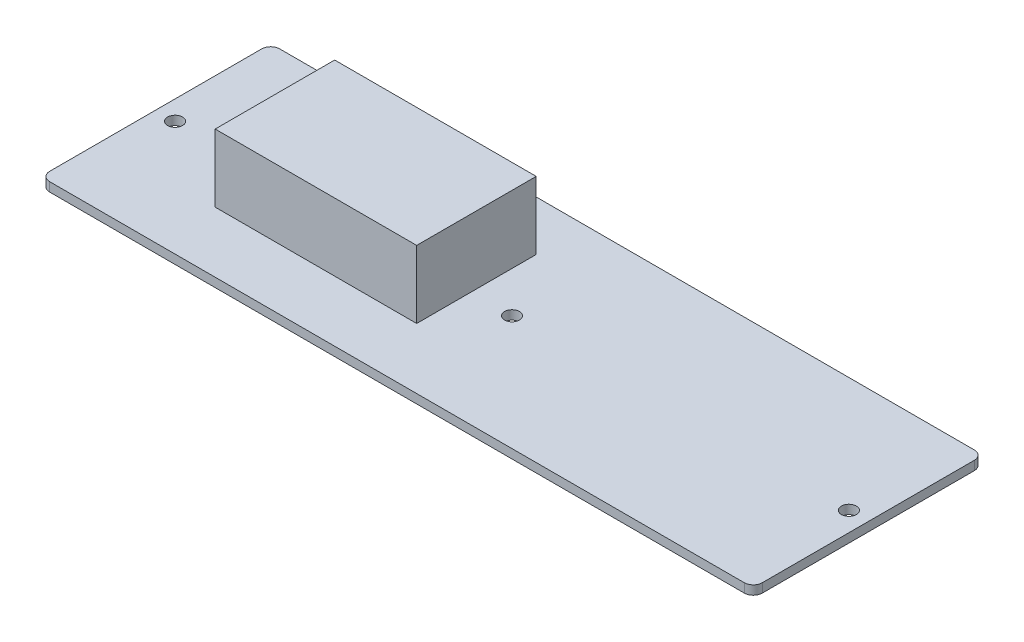
ISO-10303-21;
HEADER;
FILE_DESCRIPTION(('STEP AP214'),'2;1');
FILE_NAME('part.step','',(''),(''),'','','');
FILE_SCHEMA(('AUTOMOTIVE_DESIGN { 1 0 10303 214 1 1 1 1 }'));
ENDSEC;
DATA;
#1=APPLICATION_CONTEXT('core data for automotive mechanical design processes');
#2=APPLICATION_PROTOCOL_DEFINITION('international standard','automotive_design',2000,#1);
#3=PRODUCT_CONTEXT('',#1,'mechanical');
#4=PRODUCT('Part','Part','',(#3));
#5=PRODUCT_RELATED_PRODUCT_CATEGORY('part','',(#4));
#6=PRODUCT_DEFINITION_FORMATION('','',#4);
#7=PRODUCT_DEFINITION_CONTEXT('part definition',#1,'design');
#8=PRODUCT_DEFINITION('design','',#6,#7);
#9=PRODUCT_DEFINITION_SHAPE('','',#8);
#10=(LENGTH_UNIT() NAMED_UNIT(*) SI_UNIT(.MILLI.,.METRE.));
#11=(NAMED_UNIT(*) PLANE_ANGLE_UNIT() SI_UNIT($,.RADIAN.));
#12=(NAMED_UNIT(*) SI_UNIT($,.STERADIAN.) SOLID_ANGLE_UNIT());
#13=UNCERTAINTY_MEASURE_WITH_UNIT(LENGTH_MEASURE(1.E-05),#10,'distance_accuracy_value','');
#14=(GEOMETRIC_REPRESENTATION_CONTEXT(3) GLOBAL_UNCERTAINTY_ASSIGNED_CONTEXT((#13)) GLOBAL_UNIT_ASSIGNED_CONTEXT((#10,
#11,#12)) REPRESENTATION_CONTEXT('',''));
#15=CARTESIAN_POINT('',(0.,0.,0.));
#16=DIRECTION('',(0.,0.,1.));
#17=DIRECTION('',(1.,0.,0.));
#18=AXIS2_PLACEMENT_3D('',#15,#16,#17);
#19=CARTESIAN_POINT('',(0.,2.,0.));
#20=DIRECTION('',(0.,-1.,0.));
#21=DIRECTION('',(0.,0.,-1.));
#22=AXIS2_PLACEMENT_3D('',#19,#20,#21);
#23=PLANE('',#22);
#24=DIRECTION('',(1.,0.,0.));
#25=VECTOR('',#24,1.);
#26=CARTESIAN_POINT('',(0.,2.,0.));
#27=LINE('',#26,#25);
#28=CARTESIAN_POINT('',(2.,2.,0.));
#29=VERTEX_POINT('',#28);
#30=CARTESIAN_POINT('',(156.,2.,0.));
#31=VERTEX_POINT('',#30);
#32=EDGE_CURVE('E172',#29,#31,#27,.T.);
#33=ORIENTED_EDGE('',*,*,#32,.T.);
#34=CARTESIAN_POINT('',(156.,2.,-2.));
#35=DIRECTION('',(0.,-1.,0.));
#36=DIRECTION('',(0.,0.,-1.));
#37=AXIS2_PLACEMENT_3D('',#34,#35,#36);
#38=CIRCLE('',#37,2.);
#39=CARTESIAN_POINT('',(158.,2.,-2.));
#40=VERTEX_POINT('',#39);
#41=EDGE_CURVE('E216',#31,#40,#38,.F.);
#42=ORIENTED_EDGE('',*,*,#41,.T.);
#43=DIRECTION('',(0.,0.,-1.));
#44=VECTOR('',#43,1.);
#45=CARTESIAN_POINT('',(158.,2.,0.));
#46=LINE('',#45,#44);
#47=CARTESIAN_POINT('',(158.,2.,-49.));
#48=VERTEX_POINT('',#47);
#49=EDGE_CURVE('E176',#40,#48,#46,.T.);
#50=ORIENTED_EDGE('',*,*,#49,.T.);
#51=CARTESIAN_POINT('',(156.,2.,-49.));
#52=DIRECTION('',(0.,-1.,0.));
#53=DIRECTION('',(0.,0.,-1.));
#54=AXIS2_PLACEMENT_3D('',#51,#52,#53);
#55=CIRCLE('',#54,2.);
#56=CARTESIAN_POINT('',(156.,2.,-51.));
#57=VERTEX_POINT('',#56);
#58=EDGE_CURVE('E214',#48,#57,#55,.F.);
#59=ORIENTED_EDGE('',*,*,#58,.T.);
#60=DIRECTION('',(-1.,0.,0.));
#61=VECTOR('',#60,1.);
#62=CARTESIAN_POINT('',(0.,2.,-51.));
#63=LINE('',#62,#61);
#64=CARTESIAN_POINT('',(2.,2.,-51.));
#65=VERTEX_POINT('',#64);
#66=EDGE_CURVE('E179',#57,#65,#63,.T.);
#67=ORIENTED_EDGE('',*,*,#66,.T.);
#68=CARTESIAN_POINT('',(2.,2.,-49.));
#69=DIRECTION('',(0.,-1.,0.));
#70=DIRECTION('',(0.,0.,-1.));
#71=AXIS2_PLACEMENT_3D('',#68,#69,#70);
#72=CIRCLE('',#71,2.);
#73=CARTESIAN_POINT('',(0.,2.,-49.));
#74=VERTEX_POINT('',#73);
#75=EDGE_CURVE('E212',#65,#74,#72,.F.);
#76=ORIENTED_EDGE('',*,*,#75,.T.);
#77=DIRECTION('',(0.,0.,1.));
#78=VECTOR('',#77,1.);
#79=CARTESIAN_POINT('',(0.,2.,0.));
#80=LINE('',#79,#78);
#81=CARTESIAN_POINT('',(0.,2.,-2.));
#82=VERTEX_POINT('',#81);
#83=EDGE_CURVE('E169',#74,#82,#80,.T.);
#84=ORIENTED_EDGE('',*,*,#83,.T.);
#85=CARTESIAN_POINT('',(2.,2.,-2.));
#86=DIRECTION('',(0.,-1.,0.));
#87=DIRECTION('',(0.,0.,-1.));
#88=AXIS2_PLACEMENT_3D('',#85,#86,#87);
#89=CIRCLE('',#88,2.);
#90=EDGE_CURVE('E210',#82,#29,#89,.F.);
#91=ORIENTED_EDGE('',*,*,#90,.T.);
#92=EDGE_LOOP('',(#33,#42,#50,#59,#67,#76,#84,#91));
#93=FACE_BOUND('',#92,.T.);
#94=CARTESIAN_POINT('',(4.3,2.,-25.5));
#95=DIRECTION('',(0.,1.,0.));
#96=DIRECTION('',(0.,0.,1.));
#97=AXIS2_PLACEMENT_3D('',#94,#95,#96);
#98=CIRCLE('',#97,1.65);
#99=CARTESIAN_POINT('',(4.3,2.,-23.85));
#100=VERTEX_POINT('',#99);
#101=EDGE_CURVE('E157',#100,#100,#98,.T.);
#102=ORIENTED_EDGE('',*,*,#101,.F.);
#103=EDGE_LOOP('',(#102));
#104=FACE_BOUND('',#103,.T.);
#105=CARTESIAN_POINT('',(79.,2.,-25.5));
#106=DIRECTION('',(0.,1.,0.));
#107=DIRECTION('',(0.,0.,1.));
#108=AXIS2_PLACEMENT_3D('',#105,#106,#107);
#109=CIRCLE('',#108,1.65);
#110=CARTESIAN_POINT('',(79.,2.,-23.85));
#111=VERTEX_POINT('',#110);
#112=EDGE_CURVE('E145',#111,#111,#109,.T.);
#113=ORIENTED_EDGE('',*,*,#112,.F.);
#114=EDGE_LOOP('',(#113));
#115=FACE_BOUND('',#114,.T.);
#116=CARTESIAN_POINT('',(153.7,2.,-25.5));
#117=DIRECTION('',(0.,1.,0.));
#118=DIRECTION('',(0.,0.,-1.));
#119=AXIS2_PLACEMENT_3D('',#116,#117,#118);
#120=CIRCLE('',#119,1.64999999999999);
#121=CARTESIAN_POINT('',(153.7,2.,-27.15));
#122=VERTEX_POINT('',#121);
#123=EDGE_CURVE('E158',#122,#122,#120,.T.);
#124=ORIENTED_EDGE('',*,*,#123,.F.);
#125=EDGE_LOOP('',(#124));
#126=FACE_BOUND('',#125,.T.);
#127=DIRECTION('',(0.,0.,1.));
#128=VECTOR('',#127,1.);
#129=CARTESIAN_POINT('',(25.2313707372993,2.,-13.4540749105972));
#130=LINE('',#129,#128);
#131=CARTESIAN_POINT('',(25.2313707372993,2.,-39.9551101072841));
#132=VERTEX_POINT('',#131);
#133=CARTESIAN_POINT('',(25.2313707372993,2.,-13.4540749105972));
#134=VERTEX_POINT('',#133);
#135=EDGE_CURVE('E144',#132,#134,#130,.T.);
#136=ORIENTED_EDGE('',*,*,#135,.F.);
#137=DIRECTION('',(-1.,0.,0.));
#138=VECTOR('',#137,1.);
#139=CARTESIAN_POINT('',(25.2313707372993,2.,-39.9551101072841));
#140=LINE('',#139,#138);
#141=CARTESIAN_POINT('',(69.9108019779958,2.,-39.9551101072841));
#142=VERTEX_POINT('',#141);
#143=EDGE_CURVE('E141',#142,#132,#140,.T.);
#144=ORIENTED_EDGE('',*,*,#143,.F.);
#145=DIRECTION('',(0.,0.,-1.));
#146=VECTOR('',#145,1.);
#147=CARTESIAN_POINT('',(69.9108019779958,2.,-13.4540749105972));
#148=LINE('',#147,#146);
#149=CARTESIAN_POINT('',(69.9108019779958,2.,-13.4540749105972));
#150=VERTEX_POINT('',#149);
#151=EDGE_CURVE('E55',#150,#142,#148,.T.);
#152=ORIENTED_EDGE('',*,*,#151,.F.);
#153=DIRECTION('',(1.,0.,0.));
#154=VECTOR('',#153,1.);
#155=CARTESIAN_POINT('',(25.2313707372993,2.,-13.4540749105972));
#156=LINE('',#155,#154);
#157=EDGE_CURVE('E50',#134,#150,#156,.T.);
#158=ORIENTED_EDGE('',*,*,#157,.F.);
#159=EDGE_LOOP('',(#136,#144,#152,#158));
#160=FACE_BOUND('',#159,.T.);
#161=ADVANCED_FACE('F35',(#93,#104,#115,#126,#160),#23,.F.);
#162=CARTESIAN_POINT('',(0.,2.,0.));
#163=DIRECTION('',(1.,0.,0.));
#164=DIRECTION('',(0.,0.,-1.));
#165=AXIS2_PLACEMENT_3D('',#162,#163,#164);
#166=PLANE('',#165);
#167=ORIENTED_EDGE('',*,*,#83,.F.);
#168=DIRECTION('',(0.,-1.,0.));
#169=VECTOR('',#168,1.);
#170=CARTESIAN_POINT('',(0.,2.,-49.));
#171=LINE('',#170,#169);
#172=CARTESIAN_POINT('',(0.,0.,-49.));
#173=VERTEX_POINT('',#172);
#174=EDGE_CURVE('E11',#74,#173,#171,.T.);
#175=ORIENTED_EDGE('',*,*,#174,.T.);
#176=DIRECTION('',(0.,0.,1.));
#177=VECTOR('',#176,1.);
#178=CARTESIAN_POINT('',(0.,0.,0.));
#179=LINE('',#178,#177);
#180=CARTESIAN_POINT('',(0.,0.,-2.));
#181=VERTEX_POINT('',#180);
#182=EDGE_CURVE('E166',#173,#181,#179,.T.);
#183=ORIENTED_EDGE('',*,*,#182,.T.);
#184=DIRECTION('',(0.,-1.,0.));
#185=VECTOR('',#184,1.);
#186=CARTESIAN_POINT('',(0.,2.,-2.));
#187=LINE('',#186,#185);
#188=EDGE_CURVE('E43',#181,#82,#187,.F.);
#189=ORIENTED_EDGE('',*,*,#188,.T.);
#190=EDGE_LOOP('',(#167,#175,#183,#189));
#191=FACE_BOUND('',#190,.T.);
#192=ADVANCED_FACE('F225',(#191),#166,.F.);
#193=CARTESIAN_POINT('',(0.,2.,0.));
#194=DIRECTION('',(0.,0.,-1.));
#195=DIRECTION('',(-1.,0.,0.));
#196=AXIS2_PLACEMENT_3D('',#193,#194,#195);
#197=PLANE('',#196);
#198=DIRECTION('',(1.,0.,0.));
#199=VECTOR('',#198,1.);
#200=CARTESIAN_POINT('',(0.,0.,0.));
#201=LINE('',#200,#199);
#202=CARTESIAN_POINT('',(2.,0.,0.));
#203=VERTEX_POINT('',#202);
#204=CARTESIAN_POINT('',(156.,0.,0.));
#205=VERTEX_POINT('',#204);
#206=EDGE_CURVE('E185',#203,#205,#201,.T.);
#207=ORIENTED_EDGE('',*,*,#206,.T.);
#208=DIRECTION('',(0.,-1.,0.));
#209=VECTOR('',#208,1.);
#210=CARTESIAN_POINT('',(156.,2.,0.));
#211=LINE('',#210,#209);
#212=EDGE_CURVE('E208',#205,#31,#211,.F.);
#213=ORIENTED_EDGE('',*,*,#212,.T.);
#214=ORIENTED_EDGE('',*,*,#32,.F.);
#215=DIRECTION('',(0.,-1.,0.));
#216=VECTOR('',#215,1.);
#217=CARTESIAN_POINT('',(2.,2.,0.));
#218=LINE('',#217,#216);
#219=EDGE_CURVE('E205',#29,#203,#218,.T.);
#220=ORIENTED_EDGE('',*,*,#219,.T.);
#221=EDGE_LOOP('',(#207,#213,#214,#220));
#222=FACE_BOUND('',#221,.T.);
#223=ADVANCED_FACE('F237',(#222),#197,.F.);
#224=CARTESIAN_POINT('',(158.,2.,0.));
#225=DIRECTION('',(-1.,0.,0.));
#226=DIRECTION('',(0.,0.,1.));
#227=AXIS2_PLACEMENT_3D('',#224,#225,#226);
#228=PLANE('',#227);
#229=ORIENTED_EDGE('',*,*,#49,.F.);
#230=DIRECTION('',(0.,-1.,0.));
#231=VECTOR('',#230,1.);
#232=CARTESIAN_POINT('',(158.,2.,-2.));
#233=LINE('',#232,#231);
#234=CARTESIAN_POINT('',(158.,0.,-2.));
#235=VERTEX_POINT('',#234);
#236=EDGE_CURVE('E194',#40,#235,#233,.T.);
#237=ORIENTED_EDGE('',*,*,#236,.T.);
#238=DIRECTION('',(0.,0.,-1.));
#239=VECTOR('',#238,1.);
#240=CARTESIAN_POINT('',(158.,0.,0.));
#241=LINE('',#240,#239);
#242=CARTESIAN_POINT('',(158.,0.,-49.));
#243=VERTEX_POINT('',#242);
#244=EDGE_CURVE('E188',#235,#243,#241,.T.);
#245=ORIENTED_EDGE('',*,*,#244,.T.);
#246=DIRECTION('',(0.,-1.,0.));
#247=VECTOR('',#246,1.);
#248=CARTESIAN_POINT('',(158.,2.,-49.));
#249=LINE('',#248,#247);
#250=EDGE_CURVE('E182',#243,#48,#249,.F.);
#251=ORIENTED_EDGE('',*,*,#250,.T.);
#252=EDGE_LOOP('',(#229,#237,#245,#251));
#253=FACE_BOUND('',#252,.T.);
#254=ADVANCED_FACE('F248',(#253),#228,.F.);
#255=CARTESIAN_POINT('',(0.,2.,-51.));
#256=DIRECTION('',(0.,0.,1.));
#257=DIRECTION('',(1.,0.,0.));
#258=AXIS2_PLACEMENT_3D('',#255,#256,#257);
#259=PLANE('',#258);
#260=ORIENTED_EDGE('',*,*,#66,.F.);
#261=DIRECTION('',(0.,-1.,0.));
#262=VECTOR('',#261,1.);
#263=CARTESIAN_POINT('',(156.,2.,-51.));
#264=LINE('',#263,#262);
#265=CARTESIAN_POINT('',(156.,0.,-51.));
#266=VERTEX_POINT('',#265);
#267=EDGE_CURVE('E220',#57,#266,#264,.T.);
#268=ORIENTED_EDGE('',*,*,#267,.T.);
#269=DIRECTION('',(-1.,0.,0.));
#270=VECTOR('',#269,1.);
#271=CARTESIAN_POINT('',(0.,0.,-51.));
#272=LINE('',#271,#270);
#273=CARTESIAN_POINT('',(2.,0.,-51.));
#274=VERTEX_POINT('',#273);
#275=EDGE_CURVE('E173',#266,#274,#272,.T.);
#276=ORIENTED_EDGE('',*,*,#275,.T.);
#277=DIRECTION('',(0.,-1.,0.));
#278=VECTOR('',#277,1.);
#279=CARTESIAN_POINT('',(2.,2.,-51.));
#280=LINE('',#279,#278);
#281=EDGE_CURVE('E218',#274,#65,#280,.F.);
#282=ORIENTED_EDGE('',*,*,#281,.T.);
#283=EDGE_LOOP('',(#260,#268,#276,#282));
#284=FACE_BOUND('',#283,.T.);
#285=ADVANCED_FACE('F257',(#284),#259,.F.);
#286=CARTESIAN_POINT('',(0.,0.,0.));
#287=DIRECTION('',(0.,-1.,0.));
#288=DIRECTION('',(0.,0.,-1.));
#289=AXIS2_PLACEMENT_3D('',#286,#287,#288);
#290=PLANE('',#289);
#291=CARTESIAN_POINT('',(153.7,0.,-25.5));
#292=DIRECTION('',(0.,1.,0.));
#293=DIRECTION('',(0.,0.,-1.));
#294=AXIS2_PLACEMENT_3D('',#291,#292,#293);
#295=CIRCLE('',#294,1.64999999999999);
#296=CARTESIAN_POINT('',(153.7,0.,-27.15));
#297=VERTEX_POINT('',#296);
#298=EDGE_CURVE('E154',#297,#297,#295,.T.);
#299=ORIENTED_EDGE('',*,*,#298,.T.);
#300=EDGE_LOOP('',(#299));
#301=FACE_BOUND('',#300,.T.);
#302=CARTESIAN_POINT('',(79.,0.,-25.5));
#303=DIRECTION('',(0.,1.,0.));
#304=DIRECTION('',(0.,0.,1.));
#305=AXIS2_PLACEMENT_3D('',#302,#303,#304);
#306=CIRCLE('',#305,1.65);
#307=CARTESIAN_POINT('',(79.,0.,-23.85));
#308=VERTEX_POINT('',#307);
#309=EDGE_CURVE('E148',#308,#308,#306,.T.);
#310=ORIENTED_EDGE('',*,*,#309,.T.);
#311=EDGE_LOOP('',(#310));
#312=FACE_BOUND('',#311,.T.);
#313=CARTESIAN_POINT('',(4.3,0.,-25.5));
#314=DIRECTION('',(0.,1.,0.));
#315=DIRECTION('',(0.,0.,1.));
#316=AXIS2_PLACEMENT_3D('',#313,#314,#315);
#317=CIRCLE('',#316,1.65);
#318=CARTESIAN_POINT('',(4.3,0.,-23.85));
#319=VERTEX_POINT('',#318);
#320=EDGE_CURVE('E163',#319,#319,#317,.T.);
#321=ORIENTED_EDGE('',*,*,#320,.T.);
#322=EDGE_LOOP('',(#321));
#323=FACE_BOUND('',#322,.T.);
#324=ORIENTED_EDGE('',*,*,#244,.F.);
#325=CARTESIAN_POINT('',(156.,0.,-2.));
#326=DIRECTION('',(0.,-1.,0.));
#327=DIRECTION('',(0.,0.,-1.));
#328=AXIS2_PLACEMENT_3D('',#325,#326,#327);
#329=CIRCLE('',#328,2.);
#330=EDGE_CURVE('E203',#235,#205,#329,.T.);
#331=ORIENTED_EDGE('',*,*,#330,.T.);
#332=ORIENTED_EDGE('',*,*,#206,.F.);
#333=CARTESIAN_POINT('',(2.,0.,-2.));
#334=DIRECTION('',(0.,-1.,0.));
#335=DIRECTION('',(0.,0.,-1.));
#336=AXIS2_PLACEMENT_3D('',#333,#334,#335);
#337=CIRCLE('',#336,2.);
#338=EDGE_CURVE('E197',#203,#181,#337,.T.);
#339=ORIENTED_EDGE('',*,*,#338,.T.);
#340=ORIENTED_EDGE('',*,*,#182,.F.);
#341=CARTESIAN_POINT('',(2.,0.,-49.));
#342=DIRECTION('',(0.,-1.,0.));
#343=DIRECTION('',(0.,0.,-1.));
#344=AXIS2_PLACEMENT_3D('',#341,#342,#343);
#345=CIRCLE('',#344,2.);
#346=EDGE_CURVE('E199',#173,#274,#345,.T.);
#347=ORIENTED_EDGE('',*,*,#346,.T.);
#348=ORIENTED_EDGE('',*,*,#275,.F.);
#349=CARTESIAN_POINT('',(156.,0.,-49.));
#350=DIRECTION('',(0.,-1.,0.));
#351=DIRECTION('',(0.,0.,-1.));
#352=AXIS2_PLACEMENT_3D('',#349,#350,#351);
#353=CIRCLE('',#352,2.);
#354=EDGE_CURVE('E201',#266,#243,#353,.T.);
#355=ORIENTED_EDGE('',*,*,#354,.T.);
#356=EDGE_LOOP('',(#324,#331,#332,#339,#340,#347,#348,#355));
#357=FACE_BOUND('',#356,.T.);
#358=ADVANCED_FACE('F241',(#301,#312,#323,#357),#290,.T.);
#359=CARTESIAN_POINT('',(4.3,0.,-25.5));
#360=DIRECTION('',(0.,1.,0.));
#361=DIRECTION('',(0.,0.,1.));
#362=AXIS2_PLACEMENT_3D('',#359,#360,#361);
#363=CYLINDRICAL_SURFACE('',#362,1.65);
#364=ORIENTED_EDGE('',*,*,#320,.F.);
#365=EDGE_LOOP('',(#364));
#366=FACE_BOUND('',#365,.T.);
#367=ORIENTED_EDGE('',*,*,#101,.T.);
#368=EDGE_LOOP('',(#367));
#369=FACE_BOUND('',#368,.T.);
#370=ADVANCED_FACE('F277',(#366,#369),#363,.F.);
#371=CARTESIAN_POINT('',(79.,0.,-25.5));
#372=DIRECTION('',(0.,1.,0.));
#373=DIRECTION('',(0.,0.,1.));
#374=AXIS2_PLACEMENT_3D('',#371,#372,#373);
#375=CYLINDRICAL_SURFACE('',#374,1.65);
#376=ORIENTED_EDGE('',*,*,#309,.F.);
#377=EDGE_LOOP('',(#376));
#378=FACE_BOUND('',#377,.T.);
#379=ORIENTED_EDGE('',*,*,#112,.T.);
#380=EDGE_LOOP('',(#379));
#381=FACE_BOUND('',#380,.T.);
#382=ADVANCED_FACE('F293',(#378,#381),#375,.F.);
#383=CARTESIAN_POINT('',(153.7,0.,-25.5));
#384=DIRECTION('',(0.,1.,0.));
#385=DIRECTION('',(0.,0.,1.));
#386=AXIS2_PLACEMENT_3D('',#383,#384,#385);
#387=CYLINDRICAL_SURFACE('',#386,1.64999999999999);
#388=ORIENTED_EDGE('',*,*,#298,.F.);
#389=EDGE_LOOP('',(#388));
#390=FACE_BOUND('',#389,.T.);
#391=ORIENTED_EDGE('',*,*,#123,.T.);
#392=EDGE_LOOP('',(#391));
#393=FACE_BOUND('',#392,.T.);
#394=ADVANCED_FACE('F289',(#390,#393),#387,.F.);
#395=CARTESIAN_POINT('',(156.,2.,-2.));
#396=DIRECTION('',(0.,-1.,0.));
#397=DIRECTION('',(0.,0.,-1.));
#398=AXIS2_PLACEMENT_3D('',#395,#396,#397);
#399=CYLINDRICAL_SURFACE('',#398,2.);
#400=ORIENTED_EDGE('',*,*,#41,.F.);
#401=ORIENTED_EDGE('',*,*,#212,.F.);
#402=ORIENTED_EDGE('',*,*,#330,.F.);
#403=ORIENTED_EDGE('',*,*,#236,.F.);
#404=EDGE_LOOP('',(#400,#401,#402,#403));
#405=FACE_BOUND('',#404,.T.);
#406=ADVANCED_FACE('F245',(#405),#399,.T.);
#407=CARTESIAN_POINT('',(156.,2.,-49.));
#408=DIRECTION('',(0.,-1.,0.));
#409=DIRECTION('',(0.,0.,-1.));
#410=AXIS2_PLACEMENT_3D('',#407,#408,#409);
#411=CYLINDRICAL_SURFACE('',#410,2.);
#412=ORIENTED_EDGE('',*,*,#58,.F.);
#413=ORIENTED_EDGE('',*,*,#250,.F.);
#414=ORIENTED_EDGE('',*,*,#354,.F.);
#415=ORIENTED_EDGE('',*,*,#267,.F.);
#416=EDGE_LOOP('',(#412,#413,#414,#415));
#417=FACE_BOUND('',#416,.T.);
#418=ADVANCED_FACE('F254',(#417),#411,.T.);
#419=CARTESIAN_POINT('',(2.,2.,-49.));
#420=DIRECTION('',(0.,-1.,0.));
#421=DIRECTION('',(0.,0.,-1.));
#422=AXIS2_PLACEMENT_3D('',#419,#420,#421);
#423=CYLINDRICAL_SURFACE('',#422,2.);
#424=ORIENTED_EDGE('',*,*,#75,.F.);
#425=ORIENTED_EDGE('',*,*,#281,.F.);
#426=ORIENTED_EDGE('',*,*,#346,.F.);
#427=ORIENTED_EDGE('',*,*,#174,.F.);
#428=EDGE_LOOP('',(#424,#425,#426,#427));
#429=FACE_BOUND('',#428,.T.);
#430=ADVANCED_FACE('F260',(#429),#423,.T.);
#431=CARTESIAN_POINT('',(2.,2.,-2.));
#432=DIRECTION('',(0.,-1.,0.));
#433=DIRECTION('',(0.,0.,-1.));
#434=AXIS2_PLACEMENT_3D('',#431,#432,#433);
#435=CYLINDRICAL_SURFACE('',#434,2.);
#436=ORIENTED_EDGE('',*,*,#90,.F.);
#437=ORIENTED_EDGE('',*,*,#188,.F.);
#438=ORIENTED_EDGE('',*,*,#338,.F.);
#439=ORIENTED_EDGE('',*,*,#219,.F.);
#440=EDGE_LOOP('',(#436,#437,#438,#439));
#441=FACE_BOUND('',#440,.T.);
#442=ADVANCED_FACE('F37',(#441),#435,.T.);
#443=CARTESIAN_POINT('',(25.2313707372993,17.,-13.4540749105972));
#444=DIRECTION('',(1.,0.,0.));
#445=DIRECTION('',(0.,0.,-1.));
#446=AXIS2_PLACEMENT_3D('',#443,#444,#445);
#447=PLANE('',#446);
#448=ORIENTED_EDGE('',*,*,#135,.T.);
#449=DIRECTION('',(0.,-1.,0.));
#450=VECTOR('',#449,1.);
#451=CARTESIAN_POINT('',(25.2313707372993,17.,-13.4540749105972));
#452=LINE('',#451,#450);
#453=CARTESIAN_POINT('',(25.2313707372993,17.,-13.4540749105972));
#454=VERTEX_POINT('',#453);
#455=EDGE_CURVE('E125',#454,#134,#452,.T.);
#456=ORIENTED_EDGE('',*,*,#455,.F.);
#457=DIRECTION('',(0.,0.,1.));
#458=VECTOR('',#457,1.);
#459=CARTESIAN_POINT('',(25.2313707372993,17.,-13.4540749105972));
#460=LINE('',#459,#458);
#461=CARTESIAN_POINT('',(25.2313707372993,17.,-39.9551101072841));
#462=VERTEX_POINT('',#461);
#463=EDGE_CURVE('E132',#462,#454,#460,.T.);
#464=ORIENTED_EDGE('',*,*,#463,.F.);
#465=DIRECTION('',(0.,-1.,0.));
#466=VECTOR('',#465,1.);
#467=CARTESIAN_POINT('',(25.2313707372993,17.,-39.9551101072841));
#468=LINE('',#467,#466);
#469=EDGE_CURVE('E416',#462,#132,#468,.T.);
#470=ORIENTED_EDGE('',*,*,#469,.T.);
#471=EDGE_LOOP('',(#448,#456,#464,#470));
#472=FACE_BOUND('',#471,.T.);
#473=ADVANCED_FACE('F143',(#472),#447,.F.);
#474=CARTESIAN_POINT('',(25.2313707372993,17.,-13.4540749105972));
#475=DIRECTION('',(0.,0.,-1.));
#476=DIRECTION('',(-1.,0.,0.));
#477=AXIS2_PLACEMENT_3D('',#474,#475,#476);
#478=PLANE('',#477);
#479=ORIENTED_EDGE('',*,*,#157,.T.);
#480=DIRECTION('',(0.,-1.,0.));
#481=VECTOR('',#480,1.);
#482=CARTESIAN_POINT('',(69.9108019779958,17.,-13.4540749105972));
#483=LINE('',#482,#481);
#484=CARTESIAN_POINT('',(69.9108019779958,17.,-13.4540749105972));
#485=VERTEX_POINT('',#484);
#486=EDGE_CURVE('E128',#485,#150,#483,.T.);
#487=ORIENTED_EDGE('',*,*,#486,.F.);
#488=DIRECTION('',(1.,0.,0.));
#489=VECTOR('',#488,1.);
#490=CARTESIAN_POINT('',(25.2313707372993,17.,-13.4540749105972));
#491=LINE('',#490,#489);
#492=EDGE_CURVE('E121',#454,#485,#491,.T.);
#493=ORIENTED_EDGE('',*,*,#492,.F.);
#494=ORIENTED_EDGE('',*,*,#455,.T.);
#495=EDGE_LOOP('',(#479,#487,#493,#494));
#496=FACE_BOUND('',#495,.T.);
#497=ADVANCED_FACE('F123',(#496),#478,.F.);
#498=CARTESIAN_POINT('',(69.9108019779958,17.,-13.4540749105972));
#499=DIRECTION('',(-1.,0.,0.));
#500=DIRECTION('',(0.,0.,1.));
#501=AXIS2_PLACEMENT_3D('',#498,#499,#500);
#502=PLANE('',#501);
#503=ORIENTED_EDGE('',*,*,#151,.T.);
#504=DIRECTION('',(0.,-1.,0.));
#505=VECTOR('',#504,1.);
#506=CARTESIAN_POINT('',(69.9108019779958,17.,-39.9551101072841));
#507=LINE('',#506,#505);
#508=CARTESIAN_POINT('',(69.9108019779958,17.,-39.9551101072841));
#509=VERTEX_POINT('',#508);
#510=EDGE_CURVE('E150',#509,#142,#507,.T.);
#511=ORIENTED_EDGE('',*,*,#510,.F.);
#512=DIRECTION('',(0.,0.,-1.));
#513=VECTOR('',#512,1.);
#514=CARTESIAN_POINT('',(69.9108019779958,17.,-13.4540749105972));
#515=LINE('',#514,#513);
#516=EDGE_CURVE('E131',#485,#509,#515,.T.);
#517=ORIENTED_EDGE('',*,*,#516,.F.);
#518=ORIENTED_EDGE('',*,*,#486,.T.);
#519=EDGE_LOOP('',(#503,#511,#517,#518));
#520=FACE_BOUND('',#519,.T.);
#521=ADVANCED_FACE('F307',(#520),#502,.F.);
#522=CARTESIAN_POINT('',(25.2313707372993,17.,-39.9551101072841));
#523=DIRECTION('',(0.,0.,1.));
#524=DIRECTION('',(1.,0.,0.));
#525=AXIS2_PLACEMENT_3D('',#522,#523,#524);
#526=PLANE('',#525);
#527=ORIENTED_EDGE('',*,*,#143,.T.);
#528=ORIENTED_EDGE('',*,*,#469,.F.);
#529=DIRECTION('',(-1.,0.,0.));
#530=VECTOR('',#529,1.);
#531=CARTESIAN_POINT('',(25.2313707372993,17.,-39.9551101072841));
#532=LINE('',#531,#530);
#533=EDGE_CURVE('E137',#509,#462,#532,.T.);
#534=ORIENTED_EDGE('',*,*,#533,.F.);
#535=ORIENTED_EDGE('',*,*,#510,.T.);
#536=EDGE_LOOP('',(#527,#528,#534,#535));
#537=FACE_BOUND('',#536,.T.);
#538=ADVANCED_FACE('F310',(#537),#526,.F.);
#539=CARTESIAN_POINT('',(0.,17.,0.));
#540=DIRECTION('',(0.,-1.,0.));
#541=DIRECTION('',(0.,0.,-1.));
#542=AXIS2_PLACEMENT_3D('',#539,#540,#541);
#543=PLANE('',#542);
#544=ORIENTED_EDGE('',*,*,#463,.T.);
#545=ORIENTED_EDGE('',*,*,#492,.T.);
#546=ORIENTED_EDGE('',*,*,#516,.T.);
#547=ORIENTED_EDGE('',*,*,#533,.T.);
#548=EDGE_LOOP('',(#544,#545,#546,#547));
#549=FACE_BOUND('',#548,.T.);
#550=ADVANCED_FACE('F135',(#549),#543,.F.);
#551=CLOSED_SHELL('',(#161,#192,#223,#254,#285,#358,#370,#382,#394,#406,#418,#430,#442,#473,
#497,#521,#538,#550));
#552=MANIFOLD_SOLID_BREP('B2',#551);
#553=ADVANCED_BREP_SHAPE_REPRESENTATION('',(#18,#552),#14);
#554=SHAPE_DEFINITION_REPRESENTATION(#9,#553);
ENDSEC;
END-ISO-10303-21;
